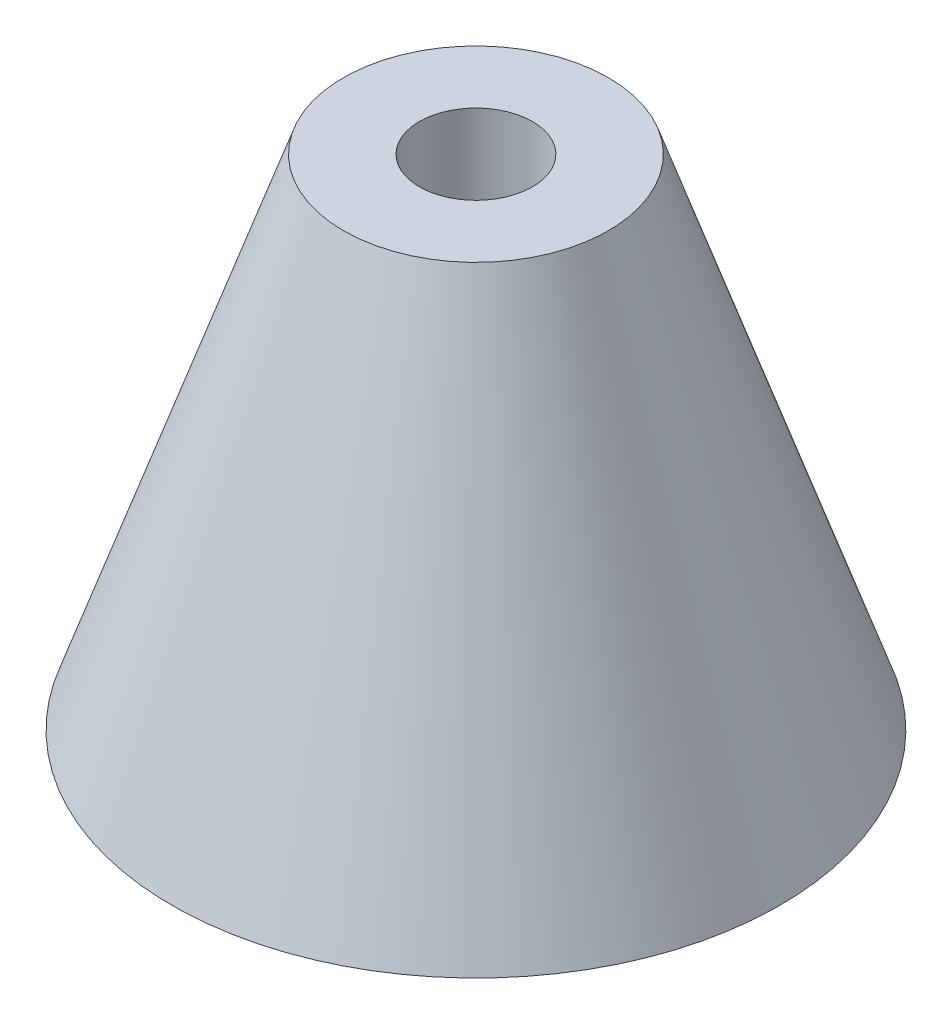
ISO-10303-21;
HEADER;
FILE_DESCRIPTION(('STEP AP214'),'2;1');
FILE_NAME('part.step','',(''),(''),'','','');
FILE_SCHEMA(('AUTOMOTIVE_DESIGN { 1 0 10303 214 1 1 1 1 }'));
ENDSEC;
DATA;
#1=APPLICATION_CONTEXT('core data for automotive mechanical design processes');
#2=APPLICATION_PROTOCOL_DEFINITION('international standard','automotive_design',2000,#1);
#3=PRODUCT_CONTEXT('',#1,'mechanical');
#4=PRODUCT('Part','Part','',(#3));
#5=PRODUCT_RELATED_PRODUCT_CATEGORY('part','',(#4));
#6=PRODUCT_DEFINITION_FORMATION('','',#4);
#7=PRODUCT_DEFINITION_CONTEXT('part definition',#1,'design');
#8=PRODUCT_DEFINITION('design','',#6,#7);
#9=PRODUCT_DEFINITION_SHAPE('','',#8);
#10=(LENGTH_UNIT() NAMED_UNIT(*) SI_UNIT(.MILLI.,.METRE.));
#11=(NAMED_UNIT(*) PLANE_ANGLE_UNIT() SI_UNIT($,.RADIAN.));
#12=(NAMED_UNIT(*) SI_UNIT($,.STERADIAN.) SOLID_ANGLE_UNIT());
#13=UNCERTAINTY_MEASURE_WITH_UNIT(LENGTH_MEASURE(1.E-05),#10,'distance_accuracy_value','');
#14=(GEOMETRIC_REPRESENTATION_CONTEXT(3) GLOBAL_UNCERTAINTY_ASSIGNED_CONTEXT((#13)) GLOBAL_UNIT_ASSIGNED_CONTEXT((#10,
#11,#12)) REPRESENTATION_CONTEXT('',''));
#15=CARTESIAN_POINT('',(0.,0.,0.));
#16=DIRECTION('',(0.,0.,1.));
#17=DIRECTION('',(1.,0.,0.));
#18=AXIS2_PLACEMENT_3D('',#15,#16,#17);
#19=CARTESIAN_POINT('',(0.,0.,0.));
#20=DIRECTION('',(0.,-1.,0.));
#21=DIRECTION('',(0.,0.,-1.));
#22=AXIS2_PLACEMENT_3D('',#19,#20,#21);
#23=CYLINDRICAL_SURFACE('',#22,2.3622);
#24=CARTESIAN_POINT('',(0.,20.828,0.));
#25=DIRECTION('',(0.,-1.,0.));
#26=DIRECTION('',(0.,0.,-1.));
#27=AXIS2_PLACEMENT_3D('',#24,#25,#26);
#28=CIRCLE('',#27,2.3622);
#29=CARTESIAN_POINT('',(0.,20.828,-2.3622));
#30=VERTEX_POINT('',#29);
#31=EDGE_CURVE('E49',#30,#30,#28,.T.);
#32=ORIENTED_EDGE('',*,*,#31,.F.);
#33=EDGE_LOOP('',(#32));
#34=FACE_BOUND('',#33,.T.);
#35=CARTESIAN_POINT('',(0.,3.0988,0.));
#36=DIRECTION('',(0.,-1.,0.));
#37=DIRECTION('',(0.,0.,-1.));
#38=AXIS2_PLACEMENT_3D('',#35,#36,#37);
#39=CIRCLE('',#38,2.3622);
#40=CARTESIAN_POINT('',(0.,3.0988,-2.3622));
#41=VERTEX_POINT('',#40);
#42=EDGE_CURVE('E43',#41,#41,#39,.F.);
#43=ORIENTED_EDGE('',*,*,#42,.F.);
#44=EDGE_LOOP('',(#43));
#45=FACE_BOUND('',#44,.T.);
#46=ADVANCED_FACE('F39',(#34,#45),#23,.F.);
#47=CARTESIAN_POINT('',(0.,20.828,0.));
#48=DIRECTION('',(0.,-1.,0.));
#49=DIRECTION('',(0.,0.,-1.));
#50=AXIS2_PLACEMENT_3D('',#47,#48,#49);
#51=CONICAL_SURFACE('',#50,5.5372,0.331232400062295);
#52=CARTESIAN_POINT('',(0.,0.,0.));
#53=DIRECTION('',(0.,-1.,0.));
#54=DIRECTION('',(0.,0.,-1.));
#55=AXIS2_PLACEMENT_3D('',#52,#53,#54);
#56=CIRCLE('',#55,12.7);
#57=CARTESIAN_POINT('',(0.,0.,-12.7));
#58=VERTEX_POINT('',#57);
#59=EDGE_CURVE('E165',#58,#58,#56,.T.);
#60=ORIENTED_EDGE('',*,*,#59,.F.);
#61=EDGE_LOOP('',(#60));
#62=FACE_BOUND('',#61,.T.);
#63=CARTESIAN_POINT('',(0.,20.828,0.));
#64=DIRECTION('',(0.,-1.,0.));
#65=DIRECTION('',(0.,0.,-1.));
#66=AXIS2_PLACEMENT_3D('',#63,#64,#65);
#67=CIRCLE('',#66,5.5372);
#68=CARTESIAN_POINT('',(0.,20.828,-5.5372));
#69=VERTEX_POINT('',#68);
#70=EDGE_CURVE('E11',#69,#69,#67,.T.);
#71=ORIENTED_EDGE('',*,*,#70,.T.);
#72=EDGE_LOOP('',(#71));
#73=FACE_BOUND('',#72,.T.);
#74=ADVANCED_FACE('F41',(#62,#73),#51,.T.);
#75=CARTESIAN_POINT('',(0.,20.828,0.));
#76=DIRECTION('',(0.,-1.,0.));
#77=DIRECTION('',(0.,0.,-1.));
#78=AXIS2_PLACEMENT_3D('',#75,#76,#77);
#79=PLANE('',#78);
#80=ORIENTED_EDGE('',*,*,#70,.F.);
#81=EDGE_LOOP('',(#80));
#82=FACE_BOUND('',#81,.T.);
#83=ORIENTED_EDGE('',*,*,#31,.T.);
#84=EDGE_LOOP('',(#83));
#85=FACE_BOUND('',#84,.T.);
#86=ADVANCED_FACE('F173',(#82,#85),#79,.F.);
#87=CARTESIAN_POINT('',(0.,0.,0.));
#88=DIRECTION('',(0.,1.,0.));
#89=DIRECTION('',(0.,0.,1.));
#90=AXIS2_PLACEMENT_3D('',#87,#88,#89);
#91=PLANE('',#90);
#92=DIRECTION('',(-0.866025403784439,0.,-0.5));
#93=VECTOR('',#92,1.);
#94=CARTESIAN_POINT('',(0.,0.,5.38194373933185));
#95=LINE('',#94,#93);
#96=CARTESIAN_POINT('',(0.,0.,5.38194373933185));
#97=VERTEX_POINT('',#96);
#98=CARTESIAN_POINT('',(-4.6609,0.,2.69097186966593));
#99=VERTEX_POINT('',#98);
#100=EDGE_CURVE('E137',#97,#99,#95,.T.);
#101=ORIENTED_EDGE('',*,*,#100,.F.);
#102=DIRECTION('',(-0.866025403784438,0.,0.500000000000001));
#103=VECTOR('',#102,1.);
#104=CARTESIAN_POINT('',(4.6609,0.,2.69097186966592));
#105=LINE('',#104,#103);
#106=CARTESIAN_POINT('',(4.6609,0.,2.69097186966592));
#107=VERTEX_POINT('',#106);
#108=EDGE_CURVE('E56',#107,#97,#105,.T.);
#109=ORIENTED_EDGE('',*,*,#108,.F.);
#110=DIRECTION('',(0.,0.,1.));
#111=VECTOR('',#110,1.);
#112=CARTESIAN_POINT('',(4.6609,0.,-2.69097186966593));
#113=LINE('',#112,#111);
#114=CARTESIAN_POINT('',(4.6609,0.,-2.69097186966593));
#115=VERTEX_POINT('',#114);
#116=EDGE_CURVE('E150',#115,#107,#113,.T.);
#117=ORIENTED_EDGE('',*,*,#116,.F.);
#118=DIRECTION('',(0.866025403784439,0.,0.5));
#119=VECTOR('',#118,1.);
#120=CARTESIAN_POINT('',(0.,0.,-5.38194373933186));
#121=LINE('',#120,#119);
#122=CARTESIAN_POINT('',(0.,0.,-5.38194373933186));
#123=VERTEX_POINT('',#122);
#124=EDGE_CURVE('E147',#123,#115,#121,.T.);
#125=ORIENTED_EDGE('',*,*,#124,.F.);
#126=DIRECTION('',(0.866025403784438,0.,-0.5));
#127=VECTOR('',#126,1.);
#128=CARTESIAN_POINT('',(-4.6609,0.,-2.69097186966593));
#129=LINE('',#128,#127);
#130=CARTESIAN_POINT('',(-4.6609,0.,-2.69097186966593));
#131=VERTEX_POINT('',#130);
#132=EDGE_CURVE('E104',#131,#123,#129,.T.);
#133=ORIENTED_EDGE('',*,*,#132,.F.);
#134=DIRECTION('',(0.,0.,-1.));
#135=VECTOR('',#134,1.);
#136=CARTESIAN_POINT('',(-4.6609,0.,2.69097186966593));
#137=LINE('',#136,#135);
#138=EDGE_CURVE('E141',#99,#131,#137,.T.);
#139=ORIENTED_EDGE('',*,*,#138,.F.);
#140=EDGE_LOOP('',(#101,#109,#117,#125,#133,#139));
#141=FACE_BOUND('',#140,.T.);
#142=ORIENTED_EDGE('',*,*,#59,.T.);
#143=EDGE_LOOP('',(#142));
#144=FACE_BOUND('',#143,.T.);
#145=ADVANCED_FACE('F183',(#141,#144),#91,.F.);
#146=CARTESIAN_POINT('',(0.,3.0988,0.));
#147=DIRECTION('',(0.,-1.,0.));
#148=DIRECTION('',(0.,0.,-1.));
#149=AXIS2_PLACEMENT_3D('',#146,#147,#148);
#150=PLANE('',#149);
#151=DIRECTION('',(-0.866025403784438,0.,0.500000000000001));
#152=VECTOR('',#151,1.);
#153=CARTESIAN_POINT('',(4.6609,3.0988,2.69097186966592));
#154=LINE('',#153,#152);
#155=CARTESIAN_POINT('',(4.6609,3.0988,2.69097186966592));
#156=VERTEX_POINT('',#155);
#157=CARTESIAN_POINT('',(0.,3.0988,5.38194373933185));
#158=VERTEX_POINT('',#157);
#159=EDGE_CURVE('E153',#156,#158,#154,.T.);
#160=ORIENTED_EDGE('',*,*,#159,.T.);
#161=DIRECTION('',(-0.866025403784439,0.,-0.5));
#162=VECTOR('',#161,1.);
#163=CARTESIAN_POINT('',(0.,3.0988,5.38194373933185));
#164=LINE('',#163,#162);
#165=CARTESIAN_POINT('',(-4.6609,3.0988,2.69097186966593));
#166=VERTEX_POINT('',#165);
#167=EDGE_CURVE('E129',#158,#166,#164,.T.);
#168=ORIENTED_EDGE('',*,*,#167,.T.);
#169=DIRECTION('',(0.,0.,-1.));
#170=VECTOR('',#169,1.);
#171=CARTESIAN_POINT('',(-4.6609,3.0988,2.69097186966593));
#172=LINE('',#171,#170);
#173=CARTESIAN_POINT('',(-4.6609,3.0988,-2.69097186966593));
#174=VERTEX_POINT('',#173);
#175=EDGE_CURVE('E125',#166,#174,#172,.T.);
#176=ORIENTED_EDGE('',*,*,#175,.T.);
#177=DIRECTION('',(0.866025403784438,0.,-0.5));
#178=VECTOR('',#177,1.);
#179=CARTESIAN_POINT('',(-4.6609,3.0988,-2.69097186966593));
#180=LINE('',#179,#178);
#181=CARTESIAN_POINT('',(0.,3.0988,-5.38194373933186));
#182=VERTEX_POINT('',#181);
#183=EDGE_CURVE('E101',#174,#182,#180,.T.);
#184=ORIENTED_EDGE('',*,*,#183,.T.);
#185=DIRECTION('',(0.866025403784439,0.,0.5));
#186=VECTOR('',#185,1.);
#187=CARTESIAN_POINT('',(0.,3.0988,-5.38194373933186));
#188=LINE('',#187,#186);
#189=CARTESIAN_POINT('',(4.6609,3.0988,-2.69097186966593));
#190=VERTEX_POINT('',#189);
#191=EDGE_CURVE('E113',#182,#190,#188,.T.);
#192=ORIENTED_EDGE('',*,*,#191,.T.);
#193=DIRECTION('',(0.,0.,1.));
#194=VECTOR('',#193,1.);
#195=CARTESIAN_POINT('',(4.6609,3.0988,-2.69097186966593));
#196=LINE('',#195,#194);
#197=EDGE_CURVE('E118',#190,#156,#196,.T.);
#198=ORIENTED_EDGE('',*,*,#197,.T.);
#199=EDGE_LOOP('',(#160,#168,#176,#184,#192,#198));
#200=FACE_BOUND('',#199,.T.);
#201=ORIENTED_EDGE('',*,*,#42,.T.);
#202=EDGE_LOOP('',(#201));
#203=FACE_BOUND('',#202,.T.);
#204=ADVANCED_FACE('F121',(#200,#203),#150,.T.);
#205=CARTESIAN_POINT('',(4.6609,3.0988,2.69097186966592));
#206=DIRECTION('',(0.500000000000001,0.,0.866025403784438));
#207=DIRECTION('',(0.866025403784438,0.,-0.500000000000001));
#208=AXIS2_PLACEMENT_3D('',#205,#206,#207);
#209=PLANE('',#208);
#210=ORIENTED_EDGE('',*,*,#108,.T.);
#211=DIRECTION('',(0.,-1.,0.));
#212=VECTOR('',#211,1.);
#213=CARTESIAN_POINT('',(0.,3.0988,5.38194373933185));
#214=LINE('',#213,#212);
#215=EDGE_CURVE('E86',#158,#97,#214,.T.);
#216=ORIENTED_EDGE('',*,*,#215,.F.);
#217=ORIENTED_EDGE('',*,*,#159,.F.);
#218=DIRECTION('',(0.,-1.,0.));
#219=VECTOR('',#218,1.);
#220=CARTESIAN_POINT('',(4.6609,3.0988,2.69097186966592));
#221=LINE('',#220,#219);
#222=EDGE_CURVE('E64',#156,#107,#221,.T.);
#223=ORIENTED_EDGE('',*,*,#222,.T.);
#224=EDGE_LOOP('',(#210,#216,#217,#223));
#225=FACE_BOUND('',#224,.T.);
#226=ADVANCED_FACE('F182',(#225),#209,.F.);
#227=CARTESIAN_POINT('',(4.6609,3.0988,-2.69097186966593));
#228=DIRECTION('',(1.,0.,0.));
#229=DIRECTION('',(0.,0.,-1.));
#230=AXIS2_PLACEMENT_3D('',#227,#228,#229);
#231=PLANE('',#230);
#232=ORIENTED_EDGE('',*,*,#116,.T.);
#233=ORIENTED_EDGE('',*,*,#222,.F.);
#234=ORIENTED_EDGE('',*,*,#197,.F.);
#235=DIRECTION('',(0.,-1.,0.));
#236=VECTOR('',#235,1.);
#237=CARTESIAN_POINT('',(4.6609,3.0988,-2.69097186966593));
#238=LINE('',#237,#236);
#239=EDGE_CURVE('E109',#190,#115,#238,.T.);
#240=ORIENTED_EDGE('',*,*,#239,.T.);
#241=EDGE_LOOP('',(#232,#233,#234,#240));
#242=FACE_BOUND('',#241,.T.);
#243=ADVANCED_FACE('F189',(#242),#231,.F.);
#244=CARTESIAN_POINT('',(0.,3.0988,-5.38194373933186));
#245=DIRECTION('',(0.5,0.,-0.866025403784439));
#246=DIRECTION('',(-0.866025403784439,0.,-0.5));
#247=AXIS2_PLACEMENT_3D('',#244,#245,#246);
#248=PLANE('',#247);
#249=ORIENTED_EDGE('',*,*,#124,.T.);
#250=ORIENTED_EDGE('',*,*,#239,.F.);
#251=ORIENTED_EDGE('',*,*,#191,.F.);
#252=DIRECTION('',(0.,-1.,0.));
#253=VECTOR('',#252,1.);
#254=CARTESIAN_POINT('',(0.,3.0988,-5.38194373933186));
#255=LINE('',#254,#253);
#256=EDGE_CURVE('E97',#182,#123,#255,.T.);
#257=ORIENTED_EDGE('',*,*,#256,.T.);
#258=EDGE_LOOP('',(#249,#250,#251,#257));
#259=FACE_BOUND('',#258,.T.);
#260=ADVANCED_FACE('F114',(#259),#248,.F.);
#261=CARTESIAN_POINT('',(-4.6609,3.0988,-2.69097186966593));
#262=DIRECTION('',(-0.5,0.,-0.866025403784438));
#263=DIRECTION('',(-0.866025403784438,0.,0.5));
#264=AXIS2_PLACEMENT_3D('',#261,#262,#263);
#265=PLANE('',#264);
#266=ORIENTED_EDGE('',*,*,#132,.T.);
#267=ORIENTED_EDGE('',*,*,#256,.F.);
#268=ORIENTED_EDGE('',*,*,#183,.F.);
#269=DIRECTION('',(0.,-1.,0.));
#270=VECTOR('',#269,1.);
#271=CARTESIAN_POINT('',(-4.6609,3.0988,-2.69097186966593));
#272=LINE('',#271,#270);
#273=EDGE_CURVE('E110',#174,#131,#272,.T.);
#274=ORIENTED_EDGE('',*,*,#273,.T.);
#275=EDGE_LOOP('',(#266,#267,#268,#274));
#276=FACE_BOUND('',#275,.T.);
#277=ADVANCED_FACE('F99',(#276),#265,.F.);
#278=CARTESIAN_POINT('',(-4.6609,3.0988,2.69097186966593));
#279=DIRECTION('',(-1.,0.,0.));
#280=DIRECTION('',(0.,0.,1.));
#281=AXIS2_PLACEMENT_3D('',#278,#279,#280);
#282=PLANE('',#281);
#283=ORIENTED_EDGE('',*,*,#138,.T.);
#284=ORIENTED_EDGE('',*,*,#273,.F.);
#285=ORIENTED_EDGE('',*,*,#175,.F.);
#286=DIRECTION('',(0.,-1.,0.));
#287=VECTOR('',#286,1.);
#288=CARTESIAN_POINT('',(-4.6609,3.0988,2.69097186966593));
#289=LINE('',#288,#287);
#290=EDGE_CURVE('E160',#166,#99,#289,.T.);
#291=ORIENTED_EDGE('',*,*,#290,.T.);
#292=EDGE_LOOP('',(#283,#284,#285,#291));
#293=FACE_BOUND('',#292,.T.);
#294=ADVANCED_FACE('F200',(#293),#282,.F.);
#295=CARTESIAN_POINT('',(0.,3.0988,5.38194373933185));
#296=DIRECTION('',(-0.5,0.,0.866025403784439));
#297=DIRECTION('',(0.866025403784439,0.,0.5));
#298=AXIS2_PLACEMENT_3D('',#295,#296,#297);
#299=PLANE('',#298);
#300=ORIENTED_EDGE('',*,*,#100,.T.);
#301=ORIENTED_EDGE('',*,*,#290,.F.);
#302=ORIENTED_EDGE('',*,*,#167,.F.);
#303=ORIENTED_EDGE('',*,*,#215,.T.);
#304=EDGE_LOOP('',(#300,#301,#302,#303));
#305=FACE_BOUND('',#304,.T.);
#306=ADVANCED_FACE('F203',(#305),#299,.F.);
#307=CLOSED_SHELL('',(#46,#74,#86,#145,#204,#226,#243,#260,#277,#294,#306));
#308=MANIFOLD_SOLID_BREP('B2',#307);
#309=ADVANCED_BREP_SHAPE_REPRESENTATION('',(#18,#308),#14);
#310=SHAPE_DEFINITION_REPRESENTATION(#9,#309);
ENDSEC;
END-ISO-10303-21;
